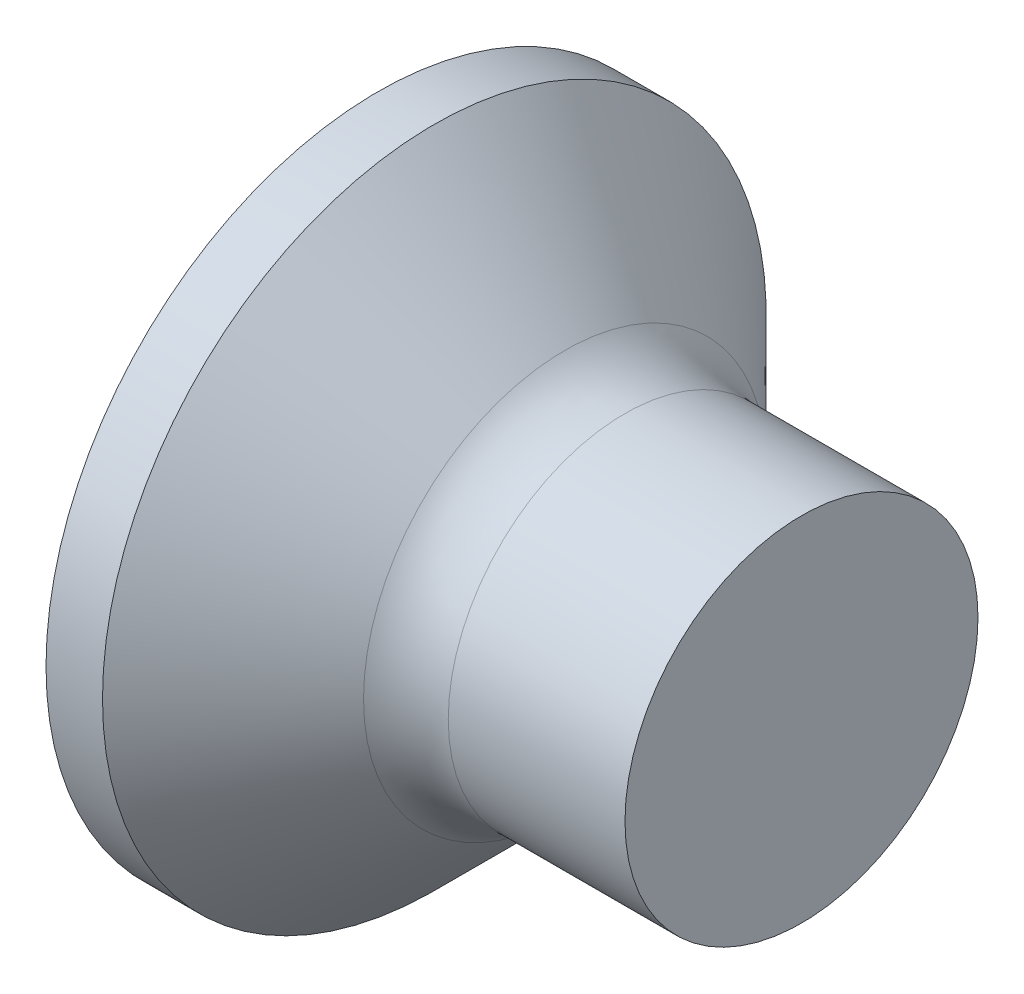
ISO-10303-21;
HEADER;
FILE_DESCRIPTION(('STEP AP214'),'2;1');
FILE_NAME('part.step','',(''),(''),'','','');
FILE_SCHEMA(('AUTOMOTIVE_DESIGN { 1 0 10303 214 1 1 1 1 }'));
ENDSEC;
DATA;
#1=APPLICATION_CONTEXT('core data for automotive mechanical design processes');
#2=APPLICATION_PROTOCOL_DEFINITION('international standard','automotive_design',2000,#1);
#3=PRODUCT_CONTEXT('',#1,'mechanical');
#4=PRODUCT('Part','Part','',(#3));
#5=PRODUCT_RELATED_PRODUCT_CATEGORY('part','',(#4));
#6=PRODUCT_DEFINITION_FORMATION('','',#4);
#7=PRODUCT_DEFINITION_CONTEXT('part definition',#1,'design');
#8=PRODUCT_DEFINITION('design','',#6,#7);
#9=PRODUCT_DEFINITION_SHAPE('','',#8);
#10=(LENGTH_UNIT() NAMED_UNIT(*) SI_UNIT(.MILLI.,.METRE.));
#11=(NAMED_UNIT(*) PLANE_ANGLE_UNIT() SI_UNIT($,.RADIAN.));
#12=(NAMED_UNIT(*) SI_UNIT($,.STERADIAN.) SOLID_ANGLE_UNIT());
#13=UNCERTAINTY_MEASURE_WITH_UNIT(LENGTH_MEASURE(1.E-05),#10,'distance_accuracy_value','');
#14=(GEOMETRIC_REPRESENTATION_CONTEXT(3) GLOBAL_UNCERTAINTY_ASSIGNED_CONTEXT((#13)) GLOBAL_UNIT_ASSIGNED_CONTEXT((#10,
#11,#12)) REPRESENTATION_CONTEXT('',''));
#15=CARTESIAN_POINT('',(0.,0.,0.));
#16=DIRECTION('',(0.,0.,1.));
#17=DIRECTION('',(1.,0.,0.));
#18=AXIS2_PLACEMENT_3D('',#15,#16,#17);
#19=CARTESIAN_POINT('',(1.73,0.37,-0.537453962312428));
#20=DIRECTION('',(-0.446197753347436,0.,0.894934391398443));
#21=DIRECTION('',(0.894934391398442,0.,0.446197753347436));
#22=AXIS2_PLACEMENT_3D('',#19,#20,#21);
#23=PLANE('',#22);
#24=DIRECTION('',(0.,1.,0.));
#25=VECTOR('',#24,1.);
#26=CARTESIAN_POINT('',(0.,0.37,-1.4));
#27=LINE('',#26,#25);
#28=CARTESIAN_POINT('',(0.,0.370000000000004,-1.4));
#29=VERTEX_POINT('',#28);
#30=CARTESIAN_POINT('',(0.,-0.369999999999995,-1.4));
#31=VERTEX_POINT('',#30);
#32=EDGE_CURVE('E174',#29,#31,#27,.F.);
#33=ORIENTED_EDGE('',*,*,#32,.T.);
#34=DIRECTION('',(-0.894934391398442,0.,-0.446197753347436));
#35=VECTOR('',#34,1.);
#36=CARTESIAN_POINT('',(1.73,-0.37,-0.53745396231243));
#37=LINE('',#36,#35);
#38=CARTESIAN_POINT('',(1.73,-0.37,-0.53745396231243));
#39=VERTEX_POINT('',#38);
#40=EDGE_CURVE('E202',#39,#31,#37,.T.);
#41=ORIENTED_EDGE('',*,*,#40,.F.);
#42=DIRECTION('',(0.,1.,0.));
#43=VECTOR('',#42,1.);
#44=CARTESIAN_POINT('',(1.73,0.37,-0.537453962312428));
#45=LINE('',#44,#43);
#46=CARTESIAN_POINT('',(1.72999999999989,-0.14240519090522,-0.537453962312431));
#47=VERTEX_POINT('',#46);
#48=EDGE_CURVE('E185',#39,#47,#45,.T.);
#49=ORIENTED_EDGE('',*,*,#48,.T.);
#50=CARTESIAN_POINT('',(2.67005399171405,0.,-0.0687604098469161));
#51=DIRECTION('',(-0.446197753347436,0.,0.894934391398443));
#52=DIRECTION('',(-0.894934391398443,0.,-0.446197753347436));
#53=AXIS2_PLACEMENT_3D('',#50,#51,#52);
#54=ELLIPSE('',#53,1.09876174310879,0.485419197280464);
#55=CARTESIAN_POINT('',(1.72999999999989,0.142405190905225,-0.537453962312429));
#56=VERTEX_POINT('',#55);
#57=EDGE_CURVE('E20',#47,#56,#54,.F.);
#58=ORIENTED_EDGE('',*,*,#57,.T.);
#59=DIRECTION('',(0.,1.,0.));
#60=VECTOR('',#59,1.);
#61=CARTESIAN_POINT('',(1.73,0.37,-0.537453962312428));
#62=LINE('',#61,#60);
#63=CARTESIAN_POINT('',(1.73,0.37,-0.537453962312428));
#64=VERTEX_POINT('',#63);
#65=EDGE_CURVE('E166',#56,#64,#62,.T.);
#66=ORIENTED_EDGE('',*,*,#65,.T.);
#67=DIRECTION('',(0.894934391398442,0.,0.446197753347436));
#68=VECTOR('',#67,1.);
#69=CARTESIAN_POINT('',(0.,0.370000000000005,-1.4));
#70=LINE('',#69,#68);
#71=EDGE_CURVE('E192',#29,#64,#70,.T.);
#72=ORIENTED_EDGE('',*,*,#71,.F.);
#73=EDGE_LOOP('',(#33,#41,#49,#58,#66,#72));
#74=FACE_BOUND('',#73,.T.);
#75=ADVANCED_FACE('F17',(#74),#23,.T.);
#76=CARTESIAN_POINT('',(1.73,-0.37,-0.53745396231243));
#77=DIRECTION('',(0.,1.,0.));
#78=DIRECTION('',(0.,0.,1.));
#79=AXIS2_PLACEMENT_3D('',#76,#77,#78);
#80=PLANE('',#79);
#81=DIRECTION('',(0.,0.,1.));
#82=VECTOR('',#81,1.);
#83=CARTESIAN_POINT('',(1.73,-0.37,-0.53745396231243));
#84=LINE('',#83,#82);
#85=CARTESIAN_POINT('',(1.73000000000445,-0.37,-0.415013252802522));
#86=VERTEX_POINT('',#85);
#87=EDGE_CURVE('E205',#86,#39,#84,.F.);
#88=ORIENTED_EDGE('',*,*,#87,.T.);
#89=ORIENTED_EDGE('',*,*,#40,.T.);
#90=DIRECTION('',(0.,0.,1.));
#91=VECTOR('',#90,1.);
#92=CARTESIAN_POINT('',(0.,-0.37,-0.53745396231243));
#93=LINE('',#92,#91);
#94=CARTESIAN_POINT('',(0.,-0.37,-0.566915305449494));
#95=VERTEX_POINT('',#94);
#96=EDGE_CURVE('E199',#31,#95,#93,.T.);
#97=ORIENTED_EDGE('',*,*,#96,.T.);
#98=CARTESIAN_POINT('',(6.21745073211009E-13,-0.37,-0.566915305449442));
#99=CARTESIAN_POINT('',(0.210211798222308,-0.37,-0.549344413477693));
#100=CARTESIAN_POINT('',(0.420407070778331,-0.37,-0.531564435264661));
#101=CARTESIAN_POINT('',(0.840738581503892,-0.37,-0.495346236705765));
#102=CARTESIAN_POINT('',(1.05087482026154,-0.37,-0.476908023170025));
#103=CARTESIAN_POINT('',(1.33915479955477,-0.37,-0.450991756825284));
#104=CARTESIAN_POINT('',(1.41733328845285,-0.37,-0.44390081102889));
#105=CARTESIAN_POINT('',(1.57367713350499,-0.37,-0.429572412876351));
#106=CARTESIAN_POINT('',(1.65184248960776,-0.37,-0.422334959960805));
#107=CARTESIAN_POINT('',(1.73000000000337,-0.37,-0.415013252805216));
#108=B_SPLINE_CURVE_WITH_KNOTS('',3,(#98,#99,#100,#101,#102,#103,#104,#105,#106,#107),
.UNSPECIFIED.,.F.,.F.,(4,2,2,2,4),(0.,0.632836027840333,1.26566551023324,1.50116361514125,
1.73666261941042),.UNSPECIFIED.);
#109=EDGE_CURVE('E504',#95,#86,#108,.T.);
#110=ORIENTED_EDGE('',*,*,#109,.T.);
#111=EDGE_LOOP('',(#88,#89,#97,#110));
#112=FACE_BOUND('',#111,.T.);
#113=ADVANCED_FACE('F522',(#112),#80,.T.);
#114=CARTESIAN_POINT('',(1.73,0.37,0.537453962312431));
#115=DIRECTION('',(0.,-1.,0.));
#116=DIRECTION('',(0.,0.,-1.));
#117=AXIS2_PLACEMENT_3D('',#114,#115,#116);
#118=PLANE('',#117);
#119=DIRECTION('',(0.,0.,-1.));
#120=VECTOR('',#119,1.);
#121=CARTESIAN_POINT('',(0.,0.37,0.537453962312431));
#122=LINE('',#121,#120);
#123=CARTESIAN_POINT('',(3.10876524219419E-13,0.37,-0.566915305449466));
#124=VERTEX_POINT('',#123);
#125=EDGE_CURVE('E195',#124,#29,#122,.T.);
#126=ORIENTED_EDGE('',*,*,#125,.T.);
#127=ORIENTED_EDGE('',*,*,#71,.T.);
#128=DIRECTION('',(0.,0.,-1.));
#129=VECTOR('',#128,1.);
#130=CARTESIAN_POINT('',(1.73,0.37,0.537453962312431));
#131=LINE('',#130,#129);
#132=CARTESIAN_POINT('',(1.73000000000445,0.37,-0.41501325280252));
#133=VERTEX_POINT('',#132);
#134=EDGE_CURVE('E170',#64,#133,#131,.F.);
#135=ORIENTED_EDGE('',*,*,#134,.T.);
#136=CARTESIAN_POINT('',(1.73000000000337,0.37,-0.415013252805141));
#137=CARTESIAN_POINT('',(1.55750312966298,0.370000000000005,-0.431158403070767));
#138=CARTESIAN_POINT('',(1.38497096483327,0.370000000000005,-0.446919624114492));
#139=CARTESIAN_POINT('',(1.03985338161292,0.370000000000002,-0.477835186705184));
#140=CARTESIAN_POINT('',(0.867267963599735,0.369999999999999,-0.492989532458464));
#141=CARTESIAN_POINT('',(0.578901935102223,0.370000000000001,-0.517935214761397));
#142=CARTESIAN_POINT('',(0.463131863674089,0.370000000000003,-0.52784915729877));
#143=CARTESIAN_POINT('',(0.231576539327035,0.370000000000005,-0.547504590063612));
#144=CARTESIAN_POINT('',(0.115791286340782,0.370000000000004,-0.55724607949823));
#145=CARTESIAN_POINT('',(6.23999141029417E-13,0.37,-0.566915305449465));
#146=B_SPLINE_CURVE_WITH_KNOTS('',3,(#136,#137,#138,#139,#140,#141,#142,#143,#144,#145),
.UNSPECIFIED.,.F.,.F.,(4,2,2,2,4),(0.,0.519751041956636,1.03949848084185,1.3880797430646,
1.73666260746864),.UNSPECIFIED.);
#147=EDGE_CURVE('E501',#133,#124,#146,.T.);
#148=ORIENTED_EDGE('',*,*,#147,.T.);
#149=EDGE_LOOP('',(#126,#127,#135,#148));
#150=FACE_BOUND('',#149,.T.);
#151=ADVANCED_FACE('F545',(#150),#118,.T.);
#152=CARTESIAN_POINT('',(0.,0.,0.));
#153=DIRECTION('',(-1.,0.,0.));
#154=DIRECTION('',(0.,0.,1.));
#155=AXIS2_PLACEMENT_3D('',#152,#153,#154);
#156=CONICAL_SURFACE('',#155,0.676973384670987,0.0698131700826303);
#157=ORIENTED_EDGE('',*,*,#109,.F.);
#158=CARTESIAN_POINT('',(0.,0.,0.));
#159=DIRECTION('',(-1.,0.,0.));
#160=DIRECTION('',(0.,0.,1.));
#161=AXIS2_PLACEMENT_3D('',#158,#159,#160);
#162=CIRCLE('',#161,0.676973384670987);
#163=CARTESIAN_POINT('',(0.,-0.566915305449493,-0.37));
#164=VERTEX_POINT('',#163);
#165=EDGE_CURVE('E194',#164,#95,#162,.F.);
#166=ORIENTED_EDGE('',*,*,#165,.F.);
#167=CARTESIAN_POINT('',(1.7300000000019,-0.41501325280528,-0.37));
#168=CARTESIAN_POINT('',(1.55750312966148,-0.431158403070909,-0.37));
#169=CARTESIAN_POINT('',(1.38497096483174,-0.446919624114635,-0.37));
#170=CARTESIAN_POINT('',(1.03985338161132,-0.477835186705327,-0.37));
#171=CARTESIAN_POINT('',(0.867267963598105,-0.492989532458608,-0.37));
#172=CARTESIAN_POINT('',(0.578901935100858,-0.517935214761515,-0.37));
#173=CARTESIAN_POINT('',(0.463131863673021,-0.527849157298863,-0.37));
#174=CARTESIAN_POINT('',(0.231576539326561,-0.547504590063654,-0.37));
#175=CARTESIAN_POINT('',(0.115791286340606,-0.557246079498248,-0.37));
#176=CARTESIAN_POINT('',(7.45224788667917E-13,-0.566915305449457,-0.37));
#177=B_SPLINE_CURVE_WITH_KNOTS('',3,(#167,#168,#169,#170,#171,#172,#173,#174,#175,#176),
.UNSPECIFIED.,.F.,.F.,(4,2,2,2,4),(0.,0.519751041956732,1.03949848084204,1.38807974306389,
1.73666260746704),.UNSPECIFIED.);
#178=CARTESIAN_POINT('',(1.73000000000445,-0.415013252802522,-0.37));
#179=VERTEX_POINT('',#178);
#180=EDGE_CURVE('E491',#179,#164,#177,.T.);
#181=ORIENTED_EDGE('',*,*,#180,.F.);
#182=CARTESIAN_POINT('',(1.73000000000912,0.,0.));
#183=DIRECTION('',(-1.,0.,0.));
#184=DIRECTION('',(0.,0.,1.));
#185=AXIS2_PLACEMENT_3D('',#182,#183,#184);
#186=CIRCLE('',#185,0.55600000000311);
#187=EDGE_CURVE('E502',#86,#179,#186,.T.);
#188=ORIENTED_EDGE('',*,*,#187,.F.);
#189=EDGE_LOOP('',(#157,#166,#181,#188));
#190=FACE_BOUND('',#189,.T.);
#191=ADVANCED_FACE('F525',(#190),#156,.F.);
#192=CARTESIAN_POINT('',(0.,0.,0.));
#193=DIRECTION('',(-1.,0.,0.));
#194=DIRECTION('',(0.,0.,1.));
#195=AXIS2_PLACEMENT_3D('',#192,#193,#194);
#196=CONICAL_SURFACE('',#195,0.676973384670987,0.0698131700826303);
#197=ORIENTED_EDGE('',*,*,#147,.F.);
#198=CARTESIAN_POINT('',(1.73000000000912,0.,0.));
#199=DIRECTION('',(-1.,0.,0.));
#200=DIRECTION('',(0.,0.,1.));
#201=AXIS2_PLACEMENT_3D('',#198,#199,#200);
#202=CIRCLE('',#201,0.55600000000311);
#203=CARTESIAN_POINT('',(1.73000000000445,0.415013252802521,-0.37));
#204=VERTEX_POINT('',#203);
#205=EDGE_CURVE('E178',#204,#133,#202,.T.);
#206=ORIENTED_EDGE('',*,*,#205,.F.);
#207=CARTESIAN_POINT('',(7.42964703682483E-13,0.566915305449431,-0.37));
#208=CARTESIAN_POINT('',(0.210211798222427,0.549344413477685,-0.37));
#209=CARTESIAN_POINT('',(0.420407070778448,0.531564435264653,-0.37));
#210=CARTESIAN_POINT('',(0.840738581504003,0.495346236705754,-0.37));
#211=CARTESIAN_POINT('',(1.05087482026165,0.476908023170013,-0.37));
#212=CARTESIAN_POINT('',(1.33915479955461,0.450991756825296,-0.37));
#213=CARTESIAN_POINT('',(1.41733328845243,0.443900811028927,-0.37));
#214=CARTESIAN_POINT('',(1.57367713350405,0.429572412876439,-0.37));
#215=CARTESIAN_POINT('',(1.65184248960656,0.422334959960918,-0.37));
#216=CARTESIAN_POINT('',(1.73000000000191,0.415013252805352,-0.37));
#217=B_SPLINE_CURVE_WITH_KNOTS('',3,(#207,#208,#209,#210,#211,#212,#213,#214,#215,#216),
.UNSPECIFIED.,.F.,.F.,(4,2,2,2,4),(0.,0.632836027840326,1.26566551023323,1.50116361514044,
1.73666261940883),.UNSPECIFIED.);
#218=CARTESIAN_POINT('',(3.71481800429003E-13,0.566915305449462,-0.37));
#219=VERTEX_POINT('',#218);
#220=EDGE_CURVE('E481',#219,#204,#217,.T.);
#221=ORIENTED_EDGE('',*,*,#220,.F.);
#222=CARTESIAN_POINT('',(0.,0.,0.));
#223=DIRECTION('',(-1.,0.,0.));
#224=DIRECTION('',(0.,0.,1.));
#225=AXIS2_PLACEMENT_3D('',#222,#223,#224);
#226=CIRCLE('',#225,0.676973384670987);
#227=EDGE_CURVE('E497',#124,#219,#226,.F.);
#228=ORIENTED_EDGE('',*,*,#227,.F.);
#229=EDGE_LOOP('',(#197,#206,#221,#228));
#230=FACE_BOUND('',#229,.T.);
#231=ADVANCED_FACE('F552',(#230),#196,.F.);
#232=CARTESIAN_POINT('',(1.73,0.53745396231243,-0.37));
#233=DIRECTION('',(0.,0.,1.));
#234=DIRECTION('',(1.,0.,0.));
#235=AXIS2_PLACEMENT_3D('',#232,#233,#234);
#236=PLANE('',#235);
#237=DIRECTION('',(0.,1.,0.));
#238=VECTOR('',#237,1.);
#239=CARTESIAN_POINT('',(0.,0.53745396231243,-0.37));
#240=LINE('',#239,#238);
#241=CARTESIAN_POINT('',(0.,-1.4,-0.37));
#242=VERTEX_POINT('',#241);
#243=EDGE_CURVE('E487',#164,#242,#240,.F.);
#244=ORIENTED_EDGE('',*,*,#243,.T.);
#245=DIRECTION('',(-0.894934391398442,-0.446197753347436,0.));
#246=VECTOR('',#245,1.);
#247=CARTESIAN_POINT('',(1.73,-0.537453962312429,-0.37));
#248=LINE('',#247,#246);
#249=CARTESIAN_POINT('',(1.73,-0.537453962312429,-0.37));
#250=VERTEX_POINT('',#249);
#251=EDGE_CURVE('E468',#250,#242,#248,.T.);
#252=ORIENTED_EDGE('',*,*,#251,.F.);
#253=DIRECTION('',(0.,1.,0.));
#254=VECTOR('',#253,1.);
#255=CARTESIAN_POINT('',(1.73,0.53745396231243,-0.37));
#256=LINE('',#255,#254);
#257=EDGE_CURVE('E494',#250,#179,#256,.T.);
#258=ORIENTED_EDGE('',*,*,#257,.T.);
#259=ORIENTED_EDGE('',*,*,#180,.T.);
#260=EDGE_LOOP('',(#244,#252,#258,#259));
#261=FACE_BOUND('',#260,.T.);
#262=ADVANCED_FACE('F591',(#261),#236,.T.);
#263=CARTESIAN_POINT('',(1.73,0.53745396231243,-0.37));
#264=DIRECTION('',(0.,0.,1.));
#265=DIRECTION('',(1.,0.,0.));
#266=AXIS2_PLACEMENT_3D('',#263,#264,#265);
#267=PLANE('',#266);
#268=DIRECTION('',(0.,1.,0.));
#269=VECTOR('',#268,1.);
#270=CARTESIAN_POINT('',(1.73,0.53745396231243,-0.37));
#271=LINE('',#270,#269);
#272=CARTESIAN_POINT('',(1.73,0.53745396231243,-0.37));
#273=VERTEX_POINT('',#272);
#274=EDGE_CURVE('E473',#204,#273,#271,.T.);
#275=ORIENTED_EDGE('',*,*,#274,.T.);
#276=DIRECTION('',(0.894934391398443,-0.446197753347435,0.));
#277=VECTOR('',#276,1.);
#278=CARTESIAN_POINT('',(1.73,0.53745396231243,-0.37));
#279=LINE('',#278,#277);
#280=CARTESIAN_POINT('',(0.,1.4,-0.37));
#281=VERTEX_POINT('',#280);
#282=EDGE_CURVE('E460',#281,#273,#279,.T.);
#283=ORIENTED_EDGE('',*,*,#282,.F.);
#284=DIRECTION('',(0.,1.,0.));
#285=VECTOR('',#284,1.);
#286=CARTESIAN_POINT('',(0.,0.53745396231243,-0.37));
#287=LINE('',#286,#285);
#288=EDGE_CURVE('E484',#281,#219,#287,.F.);
#289=ORIENTED_EDGE('',*,*,#288,.T.);
#290=ORIENTED_EDGE('',*,*,#220,.T.);
#291=EDGE_LOOP('',(#275,#283,#289,#290));
#292=FACE_BOUND('',#291,.T.);
#293=ADVANCED_FACE('F586',(#292),#267,.T.);
#294=CARTESIAN_POINT('',(3.,1.25,0.));
#295=DIRECTION('',(1.,0.,0.));
#296=DIRECTION('',(0.,0.,-1.));
#297=AXIS2_PLACEMENT_3D('',#294,#295,#296);
#298=PLANE('',#297);
#299=CARTESIAN_POINT('',(3.,0.,0.));
#300=DIRECTION('',(-1.,0.,0.));
#301=DIRECTION('',(0.,0.,1.));
#302=AXIS2_PLACEMENT_3D('',#299,#300,#301);
#303=CIRCLE('',#302,1.25);
#304=CARTESIAN_POINT('',(3.,0.,1.25));
#305=VERTEX_POINT('',#304);
#306=EDGE_CURVE('E449',#305,#305,#303,.T.);
#307=ORIENTED_EDGE('',*,*,#306,.F.);
#308=EDGE_LOOP('',(#307));
#309=FACE_BOUND('',#308,.T.);
#310=ADVANCED_FACE('F590',(#309),#298,.T.);
#311=CARTESIAN_POINT('',(1.73,-0.537453962312429,-0.37));
#312=DIRECTION('',(-0.446197753347436,0.894934391398443,0.));
#313=DIRECTION('',(-0.894934391398442,-0.446197753347436,0.));
#314=AXIS2_PLACEMENT_3D('',#311,#312,#313);
#315=PLANE('',#314);
#316=DIRECTION('',(0.,0.,1.));
#317=VECTOR('',#316,1.);
#318=CARTESIAN_POINT('',(0.,-1.4,-0.37));
#319=LINE('',#318,#317);
#320=CARTESIAN_POINT('',(0.,-1.4,0.37));
#321=VERTEX_POINT('',#320);
#322=EDGE_CURVE('E461',#242,#321,#319,.T.);
#323=ORIENTED_EDGE('',*,*,#322,.T.);
#324=DIRECTION('',(-0.894934391398442,-0.446197753347436,0.));
#325=VECTOR('',#324,1.);
#326=CARTESIAN_POINT('',(1.73,-0.537453962312429,0.37));
#327=LINE('',#326,#325);
#328=CARTESIAN_POINT('',(1.73,-0.537453962312429,0.37));
#329=VERTEX_POINT('',#328);
#330=EDGE_CURVE('E404',#329,#321,#327,.T.);
#331=ORIENTED_EDGE('',*,*,#330,.F.);
#332=DIRECTION('',(0.,0.,-1.));
#333=VECTOR('',#332,1.);
#334=CARTESIAN_POINT('',(1.73,-0.537453962312429,-0.37));
#335=LINE('',#334,#333);
#336=CARTESIAN_POINT('',(1.72999999999989,-0.53745396231243,0.142405190905223));
#337=VERTEX_POINT('',#336);
#338=EDGE_CURVE('E434',#329,#337,#335,.T.);
#339=ORIENTED_EDGE('',*,*,#338,.T.);
#340=CARTESIAN_POINT('',(2.67005399171405,-0.0687604098469161,0.));
#341=DIRECTION('',(-0.446197753347436,0.894934391398443,0.));
#342=DIRECTION('',(-0.894934391398443,-0.446197753347436,0.));
#343=AXIS2_PLACEMENT_3D('',#340,#341,#342);
#344=ELLIPSE('',#343,1.09876174310879,0.485419197280464);
#345=CARTESIAN_POINT('',(1.72999999999989,-0.53745396231243,-0.142405190905223));
#346=VERTEX_POINT('',#345);
#347=EDGE_CURVE('E426',#337,#346,#344,.F.);
#348=ORIENTED_EDGE('',*,*,#347,.T.);
#349=DIRECTION('',(0.,0.,-1.));
#350=VECTOR('',#349,1.);
#351=CARTESIAN_POINT('',(1.73,-0.537453962312429,-0.37));
#352=LINE('',#351,#350);
#353=EDGE_CURVE('E419',#346,#250,#352,.T.);
#354=ORIENTED_EDGE('',*,*,#353,.T.);
#355=ORIENTED_EDGE('',*,*,#251,.T.);
#356=EDGE_LOOP('',(#323,#331,#339,#348,#354,#355));
#357=FACE_BOUND('',#356,.T.);
#358=ADVANCED_FACE('F606',(#357),#315,.T.);
#359=CARTESIAN_POINT('',(1.73,0.53745396231243,0.37));
#360=DIRECTION('',(-0.446197753347435,-0.894934391398443,0.));
#361=DIRECTION('',(0.894934391398443,-0.446197753347435,0.));
#362=AXIS2_PLACEMENT_3D('',#359,#360,#361);
#363=PLANE('',#362);
#364=DIRECTION('',(0.,0.,1.));
#365=VECTOR('',#364,1.);
#366=CARTESIAN_POINT('',(0.,1.4,0.37));
#367=LINE('',#366,#365);
#368=CARTESIAN_POINT('',(0.,1.4,0.37));
#369=VERTEX_POINT('',#368);
#370=EDGE_CURVE('E457',#369,#281,#367,.F.);
#371=ORIENTED_EDGE('',*,*,#370,.T.);
#372=ORIENTED_EDGE('',*,*,#282,.T.);
#373=DIRECTION('',(0.,0.,-1.));
#374=VECTOR('',#373,1.);
#375=CARTESIAN_POINT('',(1.73,0.53745396231243,-0.37));
#376=LINE('',#375,#374);
#377=CARTESIAN_POINT('',(1.72999999999989,0.53745396231243,-0.142405190905222));
#378=VERTEX_POINT('',#377);
#379=EDGE_CURVE('E447',#273,#378,#376,.F.);
#380=ORIENTED_EDGE('',*,*,#379,.T.);
#381=CARTESIAN_POINT('',(2.67005399171405,0.0687604098469166,0.));
#382=DIRECTION('',(-0.446197753347435,-0.894934391398443,0.));
#383=DIRECTION('',(-0.894934391398443,0.446197753347435,0.));
#384=AXIS2_PLACEMENT_3D('',#381,#382,#383);
#385=ELLIPSE('',#384,1.09876174310879,0.485419197280464);
#386=CARTESIAN_POINT('',(1.72999999999989,0.53745396231243,0.142405190905222));
#387=VERTEX_POINT('',#386);
#388=EDGE_CURVE('E440',#378,#387,#385,.F.);
#389=ORIENTED_EDGE('',*,*,#388,.T.);
#390=DIRECTION('',(0.,0.,-1.));
#391=VECTOR('',#390,1.);
#392=CARTESIAN_POINT('',(1.73,0.53745396231243,-0.37));
#393=LINE('',#392,#391);
#394=CARTESIAN_POINT('',(1.73,0.53745396231243,0.37));
#395=VERTEX_POINT('',#394);
#396=EDGE_CURVE('E436',#387,#395,#393,.F.);
#397=ORIENTED_EDGE('',*,*,#396,.T.);
#398=DIRECTION('',(0.894934391398442,-0.446197753347436,0.));
#399=VECTOR('',#398,1.);
#400=CARTESIAN_POINT('',(0.,1.4,0.37));
#401=LINE('',#400,#399);
#402=EDGE_CURVE('E401',#369,#395,#401,.T.);
#403=ORIENTED_EDGE('',*,*,#402,.F.);
#404=EDGE_LOOP('',(#371,#372,#380,#389,#397,#403));
#405=FACE_BOUND('',#404,.T.);
#406=ADVANCED_FACE('F641',(#405),#363,.T.);
#407=CARTESIAN_POINT('',(-6.35,0.,0.));
#408=DIRECTION('',(-1.,0.,0.));
#409=DIRECTION('',(0.,0.,1.));
#410=AXIS2_PLACEMENT_3D('',#407,#408,#409);
#411=CYLINDRICAL_SURFACE('',#410,1.25);
#412=ORIENTED_EDGE('',*,*,#306,.T.);
#413=EDGE_LOOP('',(#412));
#414=FACE_BOUND('',#413,.T.);
#415=CARTESIAN_POINT('',(1.74852813742386,0.,0.));
#416=DIRECTION('',(-1.,0.,0.));
#417=DIRECTION('',(0.,0.,1.));
#418=AXIS2_PLACEMENT_3D('',#415,#416,#417);
#419=CIRCLE('',#418,1.25);
#420=CARTESIAN_POINT('',(1.74852813742386,0.,1.25));
#421=VERTEX_POINT('',#420);
#422=EDGE_CURVE('E180',#421,#421,#419,.F.);
#423=ORIENTED_EDGE('',*,*,#422,.T.);
#424=EDGE_LOOP('',(#423));
#425=FACE_BOUND('',#424,.T.);
#426=ADVANCED_FACE('F638',(#414,#425),#411,.T.);
#427=CARTESIAN_POINT('',(1.73,0.53745396231243,-0.37));
#428=DIRECTION('',(1.,0.,0.));
#429=DIRECTION('',(0.,0.,-1.));
#430=AXIS2_PLACEMENT_3D('',#427,#428,#429);
#431=PLANE('',#430);
#432=ORIENTED_EDGE('',*,*,#134,.F.);
#433=ORIENTED_EDGE('',*,*,#65,.F.);
#434=CARTESIAN_POINT('',(1.72999999999979,0.,0.));
#435=DIRECTION('',(-1.,0.,0.));
#436=DIRECTION('',(0.,0.,1.));
#437=AXIS2_PLACEMENT_3D('',#434,#435,#436);
#438=CIRCLE('',#437,0.556);
#439=EDGE_CURVE('E168',#56,#133,#438,.F.);
#440=ORIENTED_EDGE('',*,*,#439,.T.);
#441=EDGE_LOOP('',(#432,#433,#440));
#442=FACE_BOUND('',#441,.T.);
#443=ADVANCED_FACE('F167',(#442),#431,.F.);
#444=CARTESIAN_POINT('',(1.73,0.53745396231243,-0.37));
#445=DIRECTION('',(1.,0.,0.));
#446=DIRECTION('',(0.,0.,-1.));
#447=AXIS2_PLACEMENT_3D('',#444,#445,#446);
#448=PLANE('',#447);
#449=ORIENTED_EDGE('',*,*,#379,.F.);
#450=ORIENTED_EDGE('',*,*,#274,.F.);
#451=CARTESIAN_POINT('',(1.72999999999979,0.,0.));
#452=DIRECTION('',(-1.,0.,0.));
#453=DIRECTION('',(0.,0.,1.));
#454=AXIS2_PLACEMENT_3D('',#451,#452,#453);
#455=CIRCLE('',#454,0.556);
#456=EDGE_CURVE('E179',#204,#378,#455,.F.);
#457=ORIENTED_EDGE('',*,*,#456,.T.);
#458=EDGE_LOOP('',(#449,#450,#457));
#459=FACE_BOUND('',#458,.T.);
#460=ADVANCED_FACE('F631',(#459),#448,.F.);
#461=CARTESIAN_POINT('',(1.68695256780893,0.,0.));
#462=DIRECTION('',(-1.,0.,0.));
#463=DIRECTION('',(0.,0.,1.));
#464=AXIS2_PLACEMENT_3D('',#461,#462,#463);
#465=CONICAL_SURFACE('',#464,0.55901016970239,0.0698131701529839);
#466=ORIENTED_EDGE('',*,*,#388,.F.);
#467=CARTESIAN_POINT('',(1.72999999999979,0.,0.));
#468=DIRECTION('',(-1.,0.,0.));
#469=DIRECTION('',(0.,0.,1.));
#470=AXIS2_PLACEMENT_3D('',#467,#468,#469);
#471=CIRCLE('',#470,0.556);
#472=EDGE_CURVE('E443',#378,#387,#471,.F.);
#473=ORIENTED_EDGE('',*,*,#472,.T.);
#474=EDGE_LOOP('',(#466,#473));
#475=FACE_BOUND('',#474,.T.);
#476=ADVANCED_FACE('F628',(#475),#465,.F.);
#477=CARTESIAN_POINT('',(1.73,0.53745396231243,-0.37));
#478=DIRECTION('',(1.,0.,0.));
#479=DIRECTION('',(0.,0.,-1.));
#480=AXIS2_PLACEMENT_3D('',#477,#478,#479);
#481=PLANE('',#480);
#482=DIRECTION('',(0.,1.,0.));
#483=VECTOR('',#482,1.);
#484=CARTESIAN_POINT('',(1.73,-0.537453962312429,0.37));
#485=LINE('',#484,#483);
#486=CARTESIAN_POINT('',(1.73000000000445,0.41501325280252,0.37));
#487=VERTEX_POINT('',#486);
#488=EDGE_CURVE('E399',#395,#487,#485,.F.);
#489=ORIENTED_EDGE('',*,*,#488,.F.);
#490=ORIENTED_EDGE('',*,*,#396,.F.);
#491=CARTESIAN_POINT('',(1.72999999999979,0.,0.));
#492=DIRECTION('',(-1.,0.,0.));
#493=DIRECTION('',(0.,0.,1.));
#494=AXIS2_PLACEMENT_3D('',#491,#492,#493);
#495=CIRCLE('',#494,0.556);
#496=EDGE_CURVE('E446',#387,#487,#495,.F.);
#497=ORIENTED_EDGE('',*,*,#496,.T.);
#498=EDGE_LOOP('',(#489,#490,#497));
#499=FACE_BOUND('',#498,.T.);
#500=ADVANCED_FACE('F621',(#499),#481,.F.);
#501=CARTESIAN_POINT('',(1.73,0.53745396231243,-0.37));
#502=DIRECTION('',(1.,0.,0.));
#503=DIRECTION('',(0.,0.,-1.));
#504=AXIS2_PLACEMENT_3D('',#501,#502,#503);
#505=PLANE('',#504);
#506=ORIENTED_EDGE('',*,*,#338,.F.);
#507=DIRECTION('',(0.,1.,0.));
#508=VECTOR('',#507,1.);
#509=CARTESIAN_POINT('',(1.73,-0.537453962312429,0.37));
#510=LINE('',#509,#508);
#511=CARTESIAN_POINT('',(1.73000000000445,-0.41501325280252,0.37));
#512=VERTEX_POINT('',#511);
#513=EDGE_CURVE('E407',#512,#329,#510,.F.);
#514=ORIENTED_EDGE('',*,*,#513,.F.);
#515=CARTESIAN_POINT('',(1.72999999999979,0.,0.));
#516=DIRECTION('',(-1.,0.,0.));
#517=DIRECTION('',(0.,0.,1.));
#518=AXIS2_PLACEMENT_3D('',#515,#516,#517);
#519=CIRCLE('',#518,0.556);
#520=EDGE_CURVE('E433',#512,#337,#519,.F.);
#521=ORIENTED_EDGE('',*,*,#520,.T.);
#522=EDGE_LOOP('',(#506,#514,#521));
#523=FACE_BOUND('',#522,.T.);
#524=ADVANCED_FACE('F614',(#523),#505,.F.);
#525=CARTESIAN_POINT('',(1.68695256780893,0.,0.));
#526=DIRECTION('',(-1.,0.,0.));
#527=DIRECTION('',(0.,0.,1.));
#528=AXIS2_PLACEMENT_3D('',#525,#526,#527);
#529=CONICAL_SURFACE('',#528,0.55901016970239,0.0698131701529839);
#530=ORIENTED_EDGE('',*,*,#347,.F.);
#531=CARTESIAN_POINT('',(1.72999999999979,0.,0.));
#532=DIRECTION('',(-1.,0.,0.));
#533=DIRECTION('',(0.,0.,1.));
#534=AXIS2_PLACEMENT_3D('',#531,#532,#533);
#535=CIRCLE('',#534,0.556);
#536=EDGE_CURVE('E429',#337,#346,#535,.F.);
#537=ORIENTED_EDGE('',*,*,#536,.T.);
#538=EDGE_LOOP('',(#530,#537));
#539=FACE_BOUND('',#538,.T.);
#540=ADVANCED_FACE('F612',(#539),#529,.F.);
#541=CARTESIAN_POINT('',(1.73,0.53745396231243,-0.37));
#542=DIRECTION('',(1.,0.,0.));
#543=DIRECTION('',(0.,0.,-1.));
#544=AXIS2_PLACEMENT_3D('',#541,#542,#543);
#545=PLANE('',#544);
#546=ORIENTED_EDGE('',*,*,#257,.F.);
#547=ORIENTED_EDGE('',*,*,#353,.F.);
#548=CARTESIAN_POINT('',(1.72999999999979,0.,0.));
#549=DIRECTION('',(-1.,0.,0.));
#550=DIRECTION('',(0.,0.,1.));
#551=AXIS2_PLACEMENT_3D('',#548,#549,#550);
#552=CIRCLE('',#551,0.556);
#553=EDGE_CURVE('E432',#346,#179,#552,.F.);
#554=ORIENTED_EDGE('',*,*,#553,.T.);
#555=EDGE_LOOP('',(#546,#547,#554));
#556=FACE_BOUND('',#555,.T.);
#557=ADVANCED_FACE('F608',(#556),#545,.F.);
#558=CARTESIAN_POINT('',(1.73,0.53745396231243,-0.37));
#559=DIRECTION('',(1.,0.,0.));
#560=DIRECTION('',(0.,0.,-1.));
#561=AXIS2_PLACEMENT_3D('',#558,#559,#560);
#562=PLANE('',#561);
#563=ORIENTED_EDGE('',*,*,#48,.F.);
#564=ORIENTED_EDGE('',*,*,#87,.F.);
#565=CARTESIAN_POINT('',(1.72999999999979,0.,0.));
#566=DIRECTION('',(-1.,0.,0.));
#567=DIRECTION('',(0.,0.,1.));
#568=AXIS2_PLACEMENT_3D('',#565,#566,#567);
#569=CIRCLE('',#568,0.556);
#570=EDGE_CURVE('E161',#86,#47,#569,.F.);
#571=ORIENTED_EDGE('',*,*,#570,.T.);
#572=EDGE_LOOP('',(#563,#564,#571));
#573=FACE_BOUND('',#572,.T.);
#574=ADVANCED_FACE('F558',(#573),#562,.F.);
#575=CARTESIAN_POINT('',(1.68695256780893,0.,0.));
#576=DIRECTION('',(-1.,0.,0.));
#577=DIRECTION('',(0.,0.,1.));
#578=AXIS2_PLACEMENT_3D('',#575,#576,#577);
#579=CONICAL_SURFACE('',#578,0.55901016970239,0.0698131701529839);
#580=ORIENTED_EDGE('',*,*,#57,.F.);
#581=CARTESIAN_POINT('',(1.72999999999979,0.,0.));
#582=DIRECTION('',(-1.,0.,0.));
#583=DIRECTION('',(0.,0.,1.));
#584=AXIS2_PLACEMENT_3D('',#581,#582,#583);
#585=CIRCLE('',#584,0.556);
#586=EDGE_CURVE('E153',#47,#56,#585,.F.);
#587=ORIENTED_EDGE('',*,*,#586,.T.);
#588=EDGE_LOOP('',(#580,#587));
#589=FACE_BOUND('',#588,.T.);
#590=ADVANCED_FACE('F155',(#589),#579,.F.);
#591=CARTESIAN_POINT('',(1.73,-0.537453962312429,0.37));
#592=DIRECTION('',(0.,0.,-1.));
#593=DIRECTION('',(0.,1.,0.));
#594=AXIS2_PLACEMENT_3D('',#591,#592,#593);
#595=PLANE('',#594);
#596=ORIENTED_EDGE('',*,*,#513,.T.);
#597=ORIENTED_EDGE('',*,*,#330,.T.);
#598=DIRECTION('',(0.,1.,0.));
#599=VECTOR('',#598,1.);
#600=CARTESIAN_POINT('',(0.,-0.537453962312429,0.37));
#601=LINE('',#600,#599);
#602=CARTESIAN_POINT('',(0.,-0.566915305449493,0.37));
#603=VERTEX_POINT('',#602);
#604=EDGE_CURVE('E415',#321,#603,#601,.T.);
#605=ORIENTED_EDGE('',*,*,#604,.T.);
#606=CARTESIAN_POINT('',(6.21752740174333E-13,-0.566915305449441,0.37));
#607=CARTESIAN_POINT('',(0.210211798222309,-0.549344413477694,0.37));
#608=CARTESIAN_POINT('',(0.420407070778332,-0.531564435264662,0.37));
#609=CARTESIAN_POINT('',(0.840738581503893,-0.495346236705764,0.37));
#610=CARTESIAN_POINT('',(1.05087482026154,-0.476908023170023,0.37));
#611=CARTESIAN_POINT('',(1.33915479955477,-0.450991756825283,0.37));
#612=CARTESIAN_POINT('',(1.41733328845285,-0.44390081102889,0.37));
#613=CARTESIAN_POINT('',(1.57367713350499,-0.429572412876352,0.37));
#614=CARTESIAN_POINT('',(1.65184248960776,-0.422334959960805,0.37));
#615=CARTESIAN_POINT('',(1.73000000000337,-0.415013252805214,0.37));
#616=B_SPLINE_CURVE_WITH_KNOTS('',3,(#606,#607,#608,#609,#610,#611,#612,#613,#614,#615),
.UNSPECIFIED.,.F.,.F.,(4,2,2,2,4),(0.,0.632836027840335,1.26566551023325,1.50116361514125,
1.73666261941042),.UNSPECIFIED.);
#617=EDGE_CURVE('E160',#603,#512,#616,.T.);
#618=ORIENTED_EDGE('',*,*,#617,.T.);
#619=EDGE_LOOP('',(#596,#597,#605,#618));
#620=FACE_BOUND('',#619,.T.);
#621=ADVANCED_FACE('F324',(#620),#595,.T.);
#622=CARTESIAN_POINT('',(1.73,-0.537453962312429,0.37));
#623=DIRECTION('',(0.,0.,-1.));
#624=DIRECTION('',(0.,1.,0.));
#625=AXIS2_PLACEMENT_3D('',#622,#623,#624);
#626=PLANE('',#625);
#627=DIRECTION('',(0.,1.,0.));
#628=VECTOR('',#627,1.);
#629=CARTESIAN_POINT('',(0.,-0.537453962312429,0.37));
#630=LINE('',#629,#628);
#631=CARTESIAN_POINT('',(3.10876213533771E-13,0.566915305449467,0.37));
#632=VERTEX_POINT('',#631);
#633=EDGE_CURVE('E312',#632,#369,#630,.T.);
#634=ORIENTED_EDGE('',*,*,#633,.T.);
#635=ORIENTED_EDGE('',*,*,#402,.T.);
#636=ORIENTED_EDGE('',*,*,#488,.T.);
#637=CARTESIAN_POINT('',(1.73000000000337,0.415013252805142,0.37));
#638=CARTESIAN_POINT('',(1.55750312966298,0.431158403070771,0.37));
#639=CARTESIAN_POINT('',(1.38497096483327,0.446919624114496,0.37));
#640=CARTESIAN_POINT('',(1.03985338161292,0.477835186705186,0.37));
#641=CARTESIAN_POINT('',(0.867267963599735,0.492989532458465,0.37));
#642=CARTESIAN_POINT('',(0.578901935102223,0.517935214761398,0.37));
#643=CARTESIAN_POINT('',(0.463131863674089,0.527849157298772,0.37));
#644=CARTESIAN_POINT('',(0.231576539327035,0.547504590063615,0.37));
#645=CARTESIAN_POINT('',(0.115791286340782,0.557246079498233,0.37));
#646=CARTESIAN_POINT('',(6.2411602134624E-13,0.566915305449467,0.37));
#647=B_SPLINE_CURVE_WITH_KNOTS('',3,(#637,#638,#639,#640,#641,#642,#643,#644,#645,#646),
.UNSPECIFIED.,.F.,.F.,(4,2,2,2,4),(0.,0.519751041956636,1.03949848084185,1.3880797430646,
1.73666260746864),.UNSPECIFIED.);
#648=EDGE_CURVE('E329',#487,#632,#647,.T.);
#649=ORIENTED_EDGE('',*,*,#648,.T.);
#650=EDGE_LOOP('',(#634,#635,#636,#649));
#651=FACE_BOUND('',#650,.T.);
#652=ADVANCED_FACE('F319',(#651),#626,.T.);
#653=CARTESIAN_POINT('',(1.74852813742386,0.,0.));
#654=DIRECTION('',(-1.,0.,0.));
#655=DIRECTION('',(0.,0.,1.));
#656=AXIS2_PLACEMENT_3D('',#653,#654,#655);
#657=TOROIDAL_SURFACE('',#656,1.85,0.6);
#658=ORIENTED_EDGE('',*,*,#422,.F.);
#659=EDGE_LOOP('',(#658));
#660=FACE_BOUND('',#659,.T.);
#661=CARTESIAN_POINT('',(1.32426406867125,0.,0.));
#662=DIRECTION('',(-1.,0.,0.));
#663=DIRECTION('',(0.,0.,1.));
#664=AXIS2_PLACEMENT_3D('',#661,#662,#663);
#665=CIRCLE('',#664,1.42573593126372);
#666=CARTESIAN_POINT('',(1.32426406867125,0.,1.42573593126372));
#667=VERTEX_POINT('',#666);
#668=EDGE_CURVE('E300',#667,#667,#665,.T.);
#669=ORIENTED_EDGE('',*,*,#668,.F.);
#670=EDGE_LOOP('',(#669));
#671=FACE_BOUND('',#670,.T.);
#672=ADVANCED_FACE('F315',(#660,#671),#657,.F.);
#673=CARTESIAN_POINT('',(1.72999999999979,0.,0.));
#674=DIRECTION('',(-1.,0.,0.));
#675=DIRECTION('',(0.,0.,1.));
#676=AXIS2_PLACEMENT_3D('',#673,#674,#675);
#677=CONICAL_SURFACE('',#676,0.556,1.25663706143599);
#678=CARTESIAN_POINT('',(1.91065535110524,0.,0.));
#679=VERTEX_POINT('',#678);
#680=VERTEX_LOOP('',#679);
#681=FACE_BOUND('',#680,.T.);
#682=ORIENTED_EDGE('',*,*,#439,.F.);
#683=ORIENTED_EDGE('',*,*,#586,.F.);
#684=ORIENTED_EDGE('',*,*,#570,.F.);
#685=ORIENTED_EDGE('',*,*,#187,.T.);
#686=ORIENTED_EDGE('',*,*,#553,.F.);
#687=ORIENTED_EDGE('',*,*,#536,.F.);
#688=ORIENTED_EDGE('',*,*,#520,.F.);
#689=CARTESIAN_POINT('',(1.73000000000912,0.,0.));
#690=DIRECTION('',(-1.,0.,0.));
#691=DIRECTION('',(0.,0.,1.));
#692=AXIS2_PLACEMENT_3D('',#689,#690,#691);
#693=CIRCLE('',#692,0.55600000000311);
#694=CARTESIAN_POINT('',(1.73000000000445,-0.37,0.41501325280252));
#695=VERTEX_POINT('',#694);
#696=EDGE_CURVE('E305',#512,#695,#693,.T.);
#697=ORIENTED_EDGE('',*,*,#696,.T.);
#698=CARTESIAN_POINT('',(1.72999999999979,0.,0.));
#699=DIRECTION('',(-1.,0.,0.));
#700=DIRECTION('',(0.,0.,1.));
#701=AXIS2_PLACEMENT_3D('',#698,#699,#700);
#702=CIRCLE('',#701,0.556);
#703=CARTESIAN_POINT('',(1.73000000000445,-0.142405190912553,0.537453962310158));
#704=VERTEX_POINT('',#703);
#705=EDGE_CURVE('E369',#695,#704,#702,.T.);
#706=ORIENTED_EDGE('',*,*,#705,.T.);
#707=CARTESIAN_POINT('',(1.73000000000912,0.,0.));
#708=DIRECTION('',(-1.,0.,0.));
#709=DIRECTION('',(0.,0.,1.));
#710=AXIS2_PLACEMENT_3D('',#707,#708,#709);
#711=CIRCLE('',#710,0.55600000000311);
#712=CARTESIAN_POINT('',(1.73000000000445,0.142405190912552,0.537453962310158));
#713=VERTEX_POINT('',#712);
#714=EDGE_CURVE('E371',#704,#713,#711,.T.);
#715=ORIENTED_EDGE('',*,*,#714,.T.);
#716=CARTESIAN_POINT('',(1.72999999999979,0.,0.));
#717=DIRECTION('',(-1.,0.,0.));
#718=DIRECTION('',(0.,0.,1.));
#719=AXIS2_PLACEMENT_3D('',#716,#717,#718);
#720=CIRCLE('',#719,0.556);
#721=CARTESIAN_POINT('',(1.73000000000445,0.37,0.415013252802522));
#722=VERTEX_POINT('',#721);
#723=EDGE_CURVE('E309',#713,#722,#720,.T.);
#724=ORIENTED_EDGE('',*,*,#723,.T.);
#725=CARTESIAN_POINT('',(1.73000000000912,0.,0.));
#726=DIRECTION('',(-1.,0.,0.));
#727=DIRECTION('',(0.,0.,1.));
#728=AXIS2_PLACEMENT_3D('',#725,#726,#727);
#729=CIRCLE('',#728,0.55600000000311);
#730=EDGE_CURVE('E298',#722,#487,#729,.T.);
#731=ORIENTED_EDGE('',*,*,#730,.T.);
#732=ORIENTED_EDGE('',*,*,#496,.F.);
#733=ORIENTED_EDGE('',*,*,#472,.F.);
#734=ORIENTED_EDGE('',*,*,#456,.F.);
#735=ORIENTED_EDGE('',*,*,#205,.T.);
#736=EDGE_LOOP('',(#682,#683,#684,#685,#686,#687,#688,#697,#706,#715,#724,#731,#732,#733,#734,#735));
#737=FACE_BOUND('',#736,.T.);
#738=ADVANCED_FACE('F176',(#681,#737),#677,.F.);
#739=CARTESIAN_POINT('',(0.,0.,0.));
#740=DIRECTION('',(-1.,0.,0.));
#741=DIRECTION('',(0.,0.,1.));
#742=AXIS2_PLACEMENT_3D('',#739,#740,#741);
#743=CONICAL_SURFACE('',#742,0.676973384670987,0.0698131700826303);
#744=CARTESIAN_POINT('',(1.7300000000019,-0.37,0.415013252805278));
#745=CARTESIAN_POINT('',(1.55750312966148,-0.370000000000005,0.431158403070906));
#746=CARTESIAN_POINT('',(1.38497096483174,-0.370000000000005,0.446919624114632));
#747=CARTESIAN_POINT('',(1.03985338161132,-0.370000000000002,0.477835186705324));
#748=CARTESIAN_POINT('',(0.867267963598105,-0.369999999999999,0.492989532458606));
#749=CARTESIAN_POINT('',(0.578901935100858,-0.370000000000001,0.517935214761513));
#750=CARTESIAN_POINT('',(0.463131863673021,-0.370000000000003,0.52784915729886));
#751=CARTESIAN_POINT('',(0.231576539326561,-0.370000000000005,0.547504590063652));
#752=CARTESIAN_POINT('',(0.115791286340606,-0.370000000000004,0.557246079498245));
#753=CARTESIAN_POINT('',(7.45246940968618E-13,-0.37,0.566915305449455));
#754=B_SPLINE_CURVE_WITH_KNOTS('',3,(#744,#745,#746,#747,#748,#749,#750,#751,#752,#753),
.UNSPECIFIED.,.F.,.F.,(4,2,2,2,4),(0.,0.519751041956732,1.03949848084204,1.38807974306389,
1.73666260746704),.UNSPECIFIED.);
#755=CARTESIAN_POINT('',(0.,-0.37,0.566915305449492));
#756=VERTEX_POINT('',#755);
#757=EDGE_CURVE('E226',#695,#756,#754,.T.);
#758=ORIENTED_EDGE('',*,*,#757,.F.);
#759=ORIENTED_EDGE('',*,*,#696,.F.);
#760=ORIENTED_EDGE('',*,*,#617,.F.);
#761=CARTESIAN_POINT('',(0.,0.,0.));
#762=DIRECTION('',(-1.,0.,0.));
#763=DIRECTION('',(0.,0.,1.));
#764=AXIS2_PLACEMENT_3D('',#761,#762,#763);
#765=CIRCLE('',#764,0.676973384670987);
#766=EDGE_CURVE('E307',#756,#603,#765,.F.);
#767=ORIENTED_EDGE('',*,*,#766,.F.);
#768=EDGE_LOOP('',(#758,#759,#760,#767));
#769=FACE_BOUND('',#768,.T.);
#770=ADVANCED_FACE('F267',(#769),#743,.F.);
#771=CARTESIAN_POINT('',(0.,0.,0.));
#772=DIRECTION('',(-1.,0.,0.));
#773=DIRECTION('',(0.,0.,1.));
#774=AXIS2_PLACEMENT_3D('',#771,#772,#773);
#775=CONICAL_SURFACE('',#774,0.676973384670987,0.0698131700826303);
#776=CARTESIAN_POINT('',(7.42964402961748E-13,0.37,0.566915305449432));
#777=CARTESIAN_POINT('',(0.210211798222427,0.37,0.549344413477684));
#778=CARTESIAN_POINT('',(0.420407070778448,0.37,0.531564435264652));
#779=CARTESIAN_POINT('',(0.840738581504003,0.37,0.495346236705755));
#780=CARTESIAN_POINT('',(1.05087482026165,0.37,0.476908023170015));
#781=CARTESIAN_POINT('',(1.33915479955461,0.37,0.450991756825297));
#782=CARTESIAN_POINT('',(1.41733328845243,0.37,0.443900811028927));
#783=CARTESIAN_POINT('',(1.57367713350405,0.37,0.429572412876438));
#784=CARTESIAN_POINT('',(1.65184248960655,0.37,0.422334959960918));
#785=CARTESIAN_POINT('',(1.7300000000019,0.37,0.415013252805354));
#786=B_SPLINE_CURVE_WITH_KNOTS('',3,(#776,#777,#778,#779,#780,#781,#782,#783,#784,#785),
.UNSPECIFIED.,.F.,.F.,(4,2,2,2,4),(0.,0.632836027840326,1.26566551023323,1.50116361514044,
1.73666261940882),.UNSPECIFIED.);
#787=CARTESIAN_POINT('',(3.71481650068637E-13,0.37,0.566915305449463));
#788=VERTEX_POINT('',#787);
#789=EDGE_CURVE('E216',#788,#722,#786,.T.);
#790=ORIENTED_EDGE('',*,*,#789,.F.);
#791=CARTESIAN_POINT('',(0.,0.,0.));
#792=DIRECTION('',(-1.,0.,0.));
#793=DIRECTION('',(0.,0.,1.));
#794=AXIS2_PLACEMENT_3D('',#791,#792,#793);
#795=CIRCLE('',#794,0.676973384670987);
#796=EDGE_CURVE('E301',#632,#788,#795,.F.);
#797=ORIENTED_EDGE('',*,*,#796,.F.);
#798=ORIENTED_EDGE('',*,*,#648,.F.);
#799=ORIENTED_EDGE('',*,*,#730,.F.);
#800=EDGE_LOOP('',(#790,#797,#798,#799));
#801=FACE_BOUND('',#800,.T.);
#802=ADVANCED_FACE('F234',(#801),#775,.F.);
#803=CARTESIAN_POINT('',(0.400000000013279,0.,0.));
#804=DIRECTION('',(-1.,0.,0.));
#805=DIRECTION('',(0.,0.,1.));
#806=AXIS2_PLACEMENT_3D('',#803,#804,#805);
#807=CONICAL_SURFACE('',#806,2.3499999999217,0.785398163397448);
#808=ORIENTED_EDGE('',*,*,#668,.T.);
#809=EDGE_LOOP('',(#808));
#810=FACE_BOUND('',#809,.T.);
#811=CARTESIAN_POINT('',(0.400000000000005,0.,0.));
#812=DIRECTION('',(-1.,0.,0.));
#813=DIRECTION('',(0.,0.,1.));
#814=AXIS2_PLACEMENT_3D('',#811,#812,#813);
#815=CIRCLE('',#814,2.35);
#816=CARTESIAN_POINT('',(0.400000000000005,0.,2.35));
#817=VERTEX_POINT('',#816);
#818=EDGE_CURVE('E288',#817,#817,#815,.T.);
#819=ORIENTED_EDGE('',*,*,#818,.F.);
#820=EDGE_LOOP('',(#819));
#821=FACE_BOUND('',#820,.T.);
#822=ADVANCED_FACE('F259',(#810,#821),#807,.T.);
#823=CARTESIAN_POINT('',(1.73,0.53745396231243,-0.37));
#824=DIRECTION('',(1.,0.,0.));
#825=DIRECTION('',(0.,0.,-1.));
#826=AXIS2_PLACEMENT_3D('',#823,#824,#825);
#827=PLANE('',#826);
#828=DIRECTION('',(0.,1.,0.));
#829=VECTOR('',#828,1.);
#830=CARTESIAN_POINT('',(1.73,-0.37,0.537453962312429));
#831=LINE('',#830,#829);
#832=CARTESIAN_POINT('',(1.73,0.37,0.537453962312431));
#833=VERTEX_POINT('',#832);
#834=EDGE_CURVE('E215',#833,#713,#831,.F.);
#835=ORIENTED_EDGE('',*,*,#834,.F.);
#836=DIRECTION('',(0.,0.,-1.));
#837=VECTOR('',#836,1.);
#838=CARTESIAN_POINT('',(1.73,0.37,0.537453962312431));
#839=LINE('',#838,#837);
#840=EDGE_CURVE('E225',#722,#833,#839,.F.);
#841=ORIENTED_EDGE('',*,*,#840,.F.);
#842=ORIENTED_EDGE('',*,*,#723,.F.);
#843=EDGE_LOOP('',(#835,#841,#842));
#844=FACE_BOUND('',#843,.T.);
#845=ADVANCED_FACE('F256',(#844),#827,.F.);
#846=CARTESIAN_POINT('',(1.68647472582961,0.,0.));
#847=DIRECTION('',(-1.,0.,0.));
#848=DIRECTION('',(0.,0.,1.));
#849=AXIS2_PLACEMENT_3D('',#846,#847,#848);
#850=CONICAL_SURFACE('',#849,0.559043583670871,0.0698131702037254);
#851=ORIENTED_EDGE('',*,*,#714,.F.);
#852=CARTESIAN_POINT('',(2.67005399162522,0.,0.0687604098912043));
#853=DIRECTION('',(-0.446197753347435,0.,-0.894934391398443));
#854=DIRECTION('',(-0.894934391398443,0.,0.446197753347435));
#855=AXIS2_PLACEMENT_3D('',#852,#853,#854);
#856=ELLIPSE('',#855,1.09876174301528,0.485419197232052);
#857=EDGE_CURVE('E211',#713,#704,#856,.F.);
#858=ORIENTED_EDGE('',*,*,#857,.F.);
#859=EDGE_LOOP('',(#851,#858));
#860=FACE_BOUND('',#859,.T.);
#861=ADVANCED_FACE('F252',(#860),#850,.F.);
#862=CARTESIAN_POINT('',(1.73,0.53745396231243,-0.37));
#863=DIRECTION('',(1.,0.,0.));
#864=DIRECTION('',(0.,0.,-1.));
#865=AXIS2_PLACEMENT_3D('',#862,#863,#864);
#866=PLANE('',#865);
#867=DIRECTION('',(0.,0.,1.));
#868=VECTOR('',#867,1.);
#869=CARTESIAN_POINT('',(1.73,-0.37,-0.53745396231243));
#870=LINE('',#869,#868);
#871=CARTESIAN_POINT('',(1.73,-0.37,0.537453962312428));
#872=VERTEX_POINT('',#871);
#873=EDGE_CURVE('E362',#872,#695,#870,.F.);
#874=ORIENTED_EDGE('',*,*,#873,.F.);
#875=DIRECTION('',(0.,1.,0.));
#876=VECTOR('',#875,1.);
#877=CARTESIAN_POINT('',(1.73,-0.37,0.537453962312428));
#878=LINE('',#877,#876);
#879=EDGE_CURVE('E214',#704,#872,#878,.F.);
#880=ORIENTED_EDGE('',*,*,#879,.F.);
#881=ORIENTED_EDGE('',*,*,#705,.F.);
#882=EDGE_LOOP('',(#874,#880,#881));
#883=FACE_BOUND('',#882,.T.);
#884=ADVANCED_FACE('F248',(#883),#866,.F.);
#885=CARTESIAN_POINT('',(1.73,-0.37,-0.53745396231243));
#886=DIRECTION('',(0.,1.,0.));
#887=DIRECTION('',(0.,0.,1.));
#888=AXIS2_PLACEMENT_3D('',#885,#886,#887);
#889=PLANE('',#888);
#890=DIRECTION('',(0.,0.,1.));
#891=VECTOR('',#890,1.);
#892=CARTESIAN_POINT('',(0.,-0.37,-0.53745396231243));
#893=LINE('',#892,#891);
#894=CARTESIAN_POINT('',(0.,-0.37,1.4));
#895=VERTEX_POINT('',#894);
#896=EDGE_CURVE('E361',#756,#895,#893,.T.);
#897=ORIENTED_EDGE('',*,*,#896,.T.);
#898=DIRECTION('',(-0.894934391398443,0.,0.446197753347435));
#899=VECTOR('',#898,1.);
#900=CARTESIAN_POINT('',(1.73,-0.37,0.537453962312428));
#901=LINE('',#900,#899);
#902=EDGE_CURVE('E365',#872,#895,#901,.T.);
#903=ORIENTED_EDGE('',*,*,#902,.F.);
#904=ORIENTED_EDGE('',*,*,#873,.T.);
#905=ORIENTED_EDGE('',*,*,#757,.T.);
#906=EDGE_LOOP('',(#897,#903,#904,#905));
#907=FACE_BOUND('',#906,.T.);
#908=ADVANCED_FACE('F242',(#907),#889,.T.);
#909=CARTESIAN_POINT('',(1.73,0.37,0.537453962312431));
#910=DIRECTION('',(0.,-1.,0.));
#911=DIRECTION('',(0.,0.,-1.));
#912=AXIS2_PLACEMENT_3D('',#909,#910,#911);
#913=PLANE('',#912);
#914=ORIENTED_EDGE('',*,*,#840,.T.);
#915=DIRECTION('',(-0.894934391398443,0.,0.446197753347435));
#916=VECTOR('',#915,1.);
#917=CARTESIAN_POINT('',(1.73,0.369999999999995,0.53745396231243));
#918=LINE('',#917,#916);
#919=CARTESIAN_POINT('',(0.,0.369999999999995,1.4));
#920=VERTEX_POINT('',#919);
#921=EDGE_CURVE('E210',#920,#833,#918,.F.);
#922=ORIENTED_EDGE('',*,*,#921,.F.);
#923=DIRECTION('',(0.,0.,-1.));
#924=VECTOR('',#923,1.);
#925=CARTESIAN_POINT('',(0.,0.37,0.537453962312431));
#926=LINE('',#925,#924);
#927=EDGE_CURVE('E34',#920,#788,#926,.T.);
#928=ORIENTED_EDGE('',*,*,#927,.T.);
#929=ORIENTED_EDGE('',*,*,#789,.T.);
#930=EDGE_LOOP('',(#914,#922,#928,#929));
#931=FACE_BOUND('',#930,.T.);
#932=ADVANCED_FACE('F237',(#931),#913,.T.);
#933=CARTESIAN_POINT('',(-6.35,0.,0.));
#934=DIRECTION('',(-1.,0.,0.));
#935=DIRECTION('',(0.,0.,1.));
#936=AXIS2_PLACEMENT_3D('',#933,#934,#935);
#937=CYLINDRICAL_SURFACE('',#936,2.35);
#938=ORIENTED_EDGE('',*,*,#818,.T.);
#939=EDGE_LOOP('',(#938));
#940=FACE_BOUND('',#939,.T.);
#941=CARTESIAN_POINT('',(0.,0.,0.));
#942=DIRECTION('',(-1.,0.,0.));
#943=DIRECTION('',(0.,0.,1.));
#944=AXIS2_PLACEMENT_3D('',#941,#942,#943);
#945=CIRCLE('',#944,2.35);
#946=CARTESIAN_POINT('',(0.,0.,2.35));
#947=VERTEX_POINT('',#946);
#948=EDGE_CURVE('E26',#947,#947,#945,.T.);
#949=ORIENTED_EDGE('',*,*,#948,.F.);
#950=EDGE_LOOP('',(#949));
#951=FACE_BOUND('',#950,.T.);
#952=ADVANCED_FACE('F241',(#940,#951),#937,.T.);
#953=CARTESIAN_POINT('',(1.73,-0.37,0.537453962312428));
#954=DIRECTION('',(-0.446197753347435,0.,-0.894934391398443));
#955=DIRECTION('',(-0.894934391398443,0.,0.446197753347435));
#956=AXIS2_PLACEMENT_3D('',#953,#954,#955);
#957=PLANE('',#956);
#958=DIRECTION('',(0.,1.,0.));
#959=VECTOR('',#958,1.);
#960=CARTESIAN_POINT('',(0.,0.,1.4));
#961=LINE('',#960,#959);
#962=EDGE_CURVE('E11',#920,#895,#961,.F.);
#963=ORIENTED_EDGE('',*,*,#962,.F.);
#964=ORIENTED_EDGE('',*,*,#921,.T.);
#965=ORIENTED_EDGE('',*,*,#834,.T.);
#966=ORIENTED_EDGE('',*,*,#857,.T.);
#967=ORIENTED_EDGE('',*,*,#879,.T.);
#968=ORIENTED_EDGE('',*,*,#902,.T.);
#969=EDGE_LOOP('',(#963,#964,#965,#966,#967,#968));
#970=FACE_BOUND('',#969,.T.);
#971=ADVANCED_FACE('F273',(#970),#957,.T.);
#972=CARTESIAN_POINT('',(0.,0.,0.));
#973=DIRECTION('',(-1.,0.,0.));
#974=DIRECTION('',(0.,0.,1.));
#975=AXIS2_PLACEMENT_3D('',#972,#973,#974);
#976=PLANE('',#975);
#977=ORIENTED_EDGE('',*,*,#927,.F.);
#978=ORIENTED_EDGE('',*,*,#962,.T.);
#979=ORIENTED_EDGE('',*,*,#896,.F.);
#980=ORIENTED_EDGE('',*,*,#766,.T.);
#981=ORIENTED_EDGE('',*,*,#604,.F.);
#982=ORIENTED_EDGE('',*,*,#322,.F.);
#983=ORIENTED_EDGE('',*,*,#243,.F.);
#984=ORIENTED_EDGE('',*,*,#165,.T.);
#985=ORIENTED_EDGE('',*,*,#96,.F.);
#986=ORIENTED_EDGE('',*,*,#32,.F.);
#987=ORIENTED_EDGE('',*,*,#125,.F.);
#988=ORIENTED_EDGE('',*,*,#227,.T.);
#989=ORIENTED_EDGE('',*,*,#288,.F.);
#990=ORIENTED_EDGE('',*,*,#370,.F.);
#991=ORIENTED_EDGE('',*,*,#633,.F.);
#992=ORIENTED_EDGE('',*,*,#796,.T.);
#993=EDGE_LOOP('',(#977,#978,#979,#980,#981,#982,#983,#984,#985,#986,#987,#988,#989,#990,#991,#992));
#994=FACE_BOUND('',#993,.T.);
#995=ORIENTED_EDGE('',*,*,#948,.T.);
#996=EDGE_LOOP('',(#995));
#997=FACE_BOUND('',#996,.T.);
#998=ADVANCED_FACE('F271',(#994,#997),#976,.T.);
#999=CLOSED_SHELL('',(#75,#113,#151,#191,#231,#262,#293,#310,#358,#406,#426,#443,#460,#476,#500,
#524,#540,#557,#574,#590,#621,#652,#672,#738,#770,#802,#822,#845,#861,#884,#908,#932,#952,#971,#998));
#1000=MANIFOLD_SOLID_BREP('B1',#999);
#1001=ADVANCED_BREP_SHAPE_REPRESENTATION('',(#18,#1000),#14);
#1002=SHAPE_DEFINITION_REPRESENTATION(#9,#1001);
ENDSEC;
END-ISO-10303-21;
